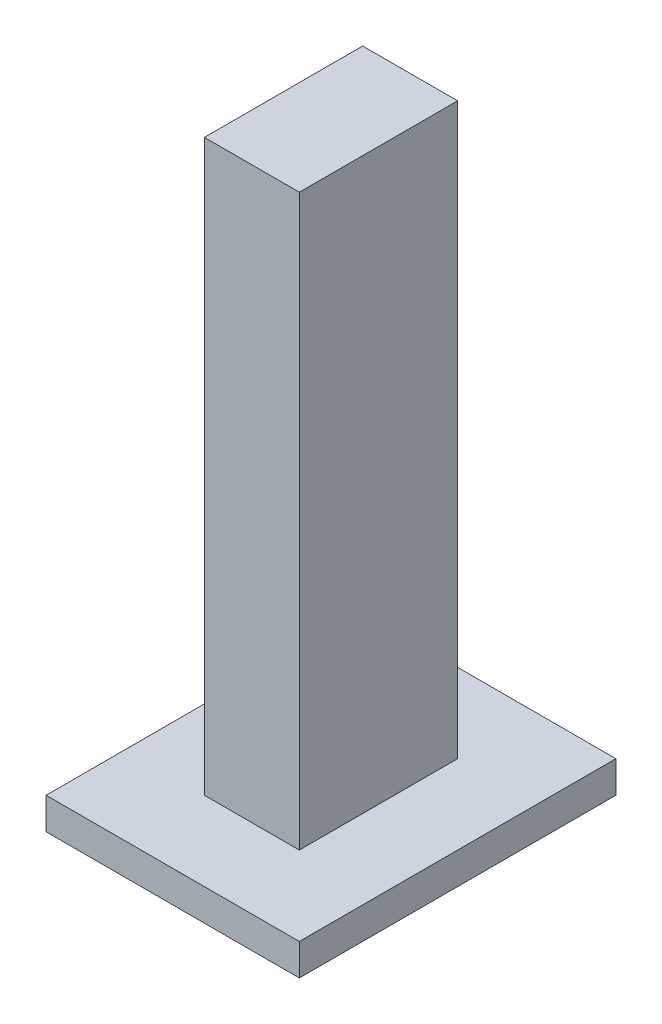
ISO-10303-21;
HEADER;
FILE_DESCRIPTION(('STEP AP214'),'2;1');
FILE_NAME('part.step','',(''),(''),'','','');
FILE_SCHEMA(('AUTOMOTIVE_DESIGN { 1 0 10303 214 1 1 1 1 }'));
ENDSEC;
DATA;
#1=APPLICATION_CONTEXT('core data for automotive mechanical design processes');
#2=APPLICATION_PROTOCOL_DEFINITION('international standard','automotive_design',2000,#1);
#3=PRODUCT_CONTEXT('',#1,'mechanical');
#4=PRODUCT('Part','Part','',(#3));
#5=PRODUCT_RELATED_PRODUCT_CATEGORY('part','',(#4));
#6=PRODUCT_DEFINITION_FORMATION('','',#4);
#7=PRODUCT_DEFINITION_CONTEXT('part definition',#1,'design');
#8=PRODUCT_DEFINITION('design','',#6,#7);
#9=PRODUCT_DEFINITION_SHAPE('','',#8);
#10=(LENGTH_UNIT() NAMED_UNIT(*) SI_UNIT(.MILLI.,.METRE.));
#11=(NAMED_UNIT(*) PLANE_ANGLE_UNIT() SI_UNIT($,.RADIAN.));
#12=(NAMED_UNIT(*) SI_UNIT($,.STERADIAN.) SOLID_ANGLE_UNIT());
#13=UNCERTAINTY_MEASURE_WITH_UNIT(LENGTH_MEASURE(1.E-05),#10,'distance_accuracy_value','');
#14=(GEOMETRIC_REPRESENTATION_CONTEXT(3) GLOBAL_UNCERTAINTY_ASSIGNED_CONTEXT((#13)) GLOBAL_UNIT_ASSIGNED_CONTEXT((#10,
#11,#12)) REPRESENTATION_CONTEXT('',''));
#15=CARTESIAN_POINT('',(0.,0.,0.));
#16=DIRECTION('',(0.,0.,1.));
#17=DIRECTION('',(1.,0.,0.));
#18=AXIS2_PLACEMENT_3D('',#15,#16,#17);
#19=CARTESIAN_POINT('',(-15.,45.,25.));
#20=DIRECTION('',(1.,0.,0.));
#21=DIRECTION('',(0.,0.,-1.));
#22=AXIS2_PLACEMENT_3D('',#19,#20,#21);
#23=PLANE('',#22);
#24=DIRECTION('',(0.,-1.,0.));
#25=VECTOR('',#24,1.);
#26=CARTESIAN_POINT('',(-15.,45.,0.));
#27=LINE('',#26,#25);
#28=CARTESIAN_POINT('',(-15.,45.,0.));
#29=VERTEX_POINT('',#28);
#30=CARTESIAN_POINT('',(-15.,-45.,0.));
#31=VERTEX_POINT('',#30);
#32=EDGE_CURVE('E140',#29,#31,#27,.T.);
#33=ORIENTED_EDGE('',*,*,#32,.T.);
#34=DIRECTION('',(0.,0.,-1.));
#35=VECTOR('',#34,1.);
#36=CARTESIAN_POINT('',(-15.,-45.,25.));
#37=LINE('',#36,#35);
#38=CARTESIAN_POINT('',(-15.,-45.,25.));
#39=VERTEX_POINT('',#38);
#40=EDGE_CURVE('E11',#39,#31,#37,.T.);
#41=ORIENTED_EDGE('',*,*,#40,.F.);
#42=DIRECTION('',(0.,-1.,0.));
#43=VECTOR('',#42,1.);
#44=CARTESIAN_POINT('',(-15.,45.,25.));
#45=LINE('',#44,#43);
#46=CARTESIAN_POINT('',(-15.,45.,25.));
#47=VERTEX_POINT('',#46);
#48=EDGE_CURVE('E81',#47,#39,#45,.T.);
#49=ORIENTED_EDGE('',*,*,#48,.F.);
#50=DIRECTION('',(0.,0.,-1.));
#51=VECTOR('',#50,1.);
#52=CARTESIAN_POINT('',(-15.,45.,25.));
#53=LINE('',#52,#51);
#54=EDGE_CURVE('E159',#47,#29,#53,.T.);
#55=ORIENTED_EDGE('',*,*,#54,.T.);
#56=EDGE_LOOP('',(#33,#41,#49,#55));
#57=FACE_BOUND('',#56,.T.);
#58=ADVANCED_FACE('F39',(#57),#23,.F.);
#59=CARTESIAN_POINT('',(0.,45.,25.));
#60=DIRECTION('',(-1.,0.,0.));
#61=DIRECTION('',(0.,0.,1.));
#62=AXIS2_PLACEMENT_3D('',#59,#60,#61);
#63=PLANE('',#62);
#64=DIRECTION('',(0.,1.,0.));
#65=VECTOR('',#64,1.);
#66=CARTESIAN_POINT('',(0.,45.,0.));
#67=LINE('',#66,#65);
#68=CARTESIAN_POINT('',(0.,-45.,0.));
#69=VERTEX_POINT('',#68);
#70=CARTESIAN_POINT('',(0.,45.,0.));
#71=VERTEX_POINT('',#70);
#72=EDGE_CURVE('E70',#69,#71,#67,.T.);
#73=ORIENTED_EDGE('',*,*,#72,.T.);
#74=DIRECTION('',(0.,0.,-1.));
#75=VECTOR('',#74,1.);
#76=CARTESIAN_POINT('',(0.,45.,25.));
#77=LINE('',#76,#75);
#78=CARTESIAN_POINT('',(0.,45.,25.));
#79=VERTEX_POINT('',#78);
#80=EDGE_CURVE('E170',#79,#71,#77,.T.);
#81=ORIENTED_EDGE('',*,*,#80,.F.);
#82=DIRECTION('',(0.,1.,0.));
#83=VECTOR('',#82,1.);
#84=CARTESIAN_POINT('',(0.,45.,25.));
#85=LINE('',#84,#83);
#86=CARTESIAN_POINT('',(0.,-45.,25.));
#87=VERTEX_POINT('',#86);
#88=EDGE_CURVE('E155',#87,#79,#85,.T.);
#89=ORIENTED_EDGE('',*,*,#88,.F.);
#90=DIRECTION('',(0.,0.,-1.));
#91=VECTOR('',#90,1.);
#92=CARTESIAN_POINT('',(0.,-45.,25.));
#93=LINE('',#92,#91);
#94=EDGE_CURVE('E48',#87,#69,#93,.T.);
#95=ORIENTED_EDGE('',*,*,#94,.T.);
#96=EDGE_LOOP('',(#73,#81,#89,#95));
#97=FACE_BOUND('',#96,.T.);
#98=ADVANCED_FACE('F175',(#97),#63,.F.);
#99=CARTESIAN_POINT('',(-15.,45.,25.));
#100=DIRECTION('',(0.,-1.,0.));
#101=DIRECTION('',(0.,0.,-1.));
#102=AXIS2_PLACEMENT_3D('',#99,#100,#101);
#103=PLANE('',#102);
#104=DIRECTION('',(-1.,0.,0.));
#105=VECTOR('',#104,1.);
#106=CARTESIAN_POINT('',(-15.,45.,0.));
#107=LINE('',#106,#105);
#108=EDGE_CURVE('E76',#71,#29,#107,.T.);
#109=ORIENTED_EDGE('',*,*,#108,.T.);
#110=ORIENTED_EDGE('',*,*,#54,.F.);
#111=DIRECTION('',(-1.,0.,0.));
#112=VECTOR('',#111,1.);
#113=CARTESIAN_POINT('',(-15.,45.,25.));
#114=LINE('',#113,#112);
#115=EDGE_CURVE('E56',#79,#47,#114,.T.);
#116=ORIENTED_EDGE('',*,*,#115,.F.);
#117=ORIENTED_EDGE('',*,*,#80,.T.);
#118=EDGE_LOOP('',(#109,#110,#116,#117));
#119=FACE_BOUND('',#118,.T.);
#120=ADVANCED_FACE('F184',(#119),#103,.F.);
#121=CARTESIAN_POINT('',(0.,0.,25.));
#122=DIRECTION('',(0.,0.,1.));
#123=DIRECTION('',(1.,0.,0.));
#124=AXIS2_PLACEMENT_3D('',#121,#122,#123);
#125=PLANE('',#124);
#126=ORIENTED_EDGE('',*,*,#48,.T.);
#127=DIRECTION('',(1.,0.,0.));
#128=VECTOR('',#127,1.);
#129=CARTESIAN_POINT('',(-15.,-45.,25.));
#130=LINE('',#129,#128);
#131=EDGE_CURVE('E152',#39,#87,#130,.T.);
#132=ORIENTED_EDGE('',*,*,#131,.T.);
#133=ORIENTED_EDGE('',*,*,#88,.T.);
#134=ORIENTED_EDGE('',*,*,#115,.T.);
#135=EDGE_LOOP('',(#126,#132,#133,#134));
#136=FACE_BOUND('',#135,.T.);
#137=ADVANCED_FACE('F186',(#136),#125,.T.);
#138=CARTESIAN_POINT('',(0.,0.,0.));
#139=DIRECTION('',(0.,0.,1.));
#140=DIRECTION('',(1.,0.,0.));
#141=AXIS2_PLACEMENT_3D('',#138,#139,#140);
#142=PLANE('',#141);
#143=ORIENTED_EDGE('',*,*,#32,.F.);
#144=ORIENTED_EDGE('',*,*,#108,.F.);
#145=ORIENTED_EDGE('',*,*,#72,.F.);
#146=DIRECTION('',(1.,0.,0.));
#147=VECTOR('',#146,1.);
#148=CARTESIAN_POINT('',(-15.,-45.,0.));
#149=LINE('',#148,#147);
#150=EDGE_CURVE('E144',#31,#69,#149,.T.);
#151=ORIENTED_EDGE('',*,*,#150,.F.);
#152=EDGE_LOOP('',(#143,#144,#145,#151));
#153=FACE_BOUND('',#152,.T.);
#154=ADVANCED_FACE('F181',(#153),#142,.F.);
#155=CARTESIAN_POINT('',(0.,-45.,0.));
#156=DIRECTION('',(0.,-1.,0.));
#157=DIRECTION('',(0.,0.,-1.));
#158=AXIS2_PLACEMENT_3D('',#155,#156,#157);
#159=PLANE('',#158);
#160=DIRECTION('',(0.,0.,-1.));
#161=VECTOR('',#160,1.);
#162=CARTESIAN_POINT('',(-27.5,-45.,37.5));
#163=LINE('',#162,#161);
#164=CARTESIAN_POINT('',(-27.5,-45.,37.5));
#165=VERTEX_POINT('',#164);
#166=CARTESIAN_POINT('',(-27.5,-45.,-12.5));
#167=VERTEX_POINT('',#166);
#168=EDGE_CURVE('E138',#165,#167,#163,.T.);
#169=ORIENTED_EDGE('',*,*,#168,.F.);
#170=DIRECTION('',(-1.,0.,0.));
#171=VECTOR('',#170,1.);
#172=CARTESIAN_POINT('',(-27.5,-45.,37.5));
#173=LINE('',#172,#171);
#174=CARTESIAN_POINT('',(12.5,-45.,37.5));
#175=VERTEX_POINT('',#174);
#176=EDGE_CURVE('E134',#175,#165,#173,.T.);
#177=ORIENTED_EDGE('',*,*,#176,.F.);
#178=DIRECTION('',(0.,0.,1.));
#179=VECTOR('',#178,1.);
#180=CARTESIAN_POINT('',(12.5,-45.,37.5));
#181=LINE('',#180,#179);
#182=CARTESIAN_POINT('',(12.5,-45.,-12.5));
#183=VERTEX_POINT('',#182);
#184=EDGE_CURVE('E278',#183,#175,#181,.T.);
#185=ORIENTED_EDGE('',*,*,#184,.F.);
#186=DIRECTION('',(1.,0.,0.));
#187=VECTOR('',#186,1.);
#188=CARTESIAN_POINT('',(-27.5,-45.,-12.5));
#189=LINE('',#188,#187);
#190=EDGE_CURVE('E282',#167,#183,#189,.T.);
#191=ORIENTED_EDGE('',*,*,#190,.F.);
#192=EDGE_LOOP('',(#169,#177,#185,#191));
#193=FACE_BOUND('',#192,.T.);
#194=ORIENTED_EDGE('',*,*,#40,.T.);
#195=ORIENTED_EDGE('',*,*,#150,.T.);
#196=ORIENTED_EDGE('',*,*,#94,.F.);
#197=ORIENTED_EDGE('',*,*,#131,.F.);
#198=EDGE_LOOP('',(#194,#195,#196,#197));
#199=FACE_BOUND('',#198,.T.);
#200=ADVANCED_FACE('F182',(#193,#199),#159,.F.);
#201=CARTESIAN_POINT('',(-27.5,-50.,37.5));
#202=DIRECTION('',(1.,0.,0.));
#203=DIRECTION('',(0.,0.,-1.));
#204=AXIS2_PLACEMENT_3D('',#201,#202,#203);
#205=PLANE('',#204);
#206=ORIENTED_EDGE('',*,*,#168,.T.);
#207=DIRECTION('',(0.,1.,0.));
#208=VECTOR('',#207,1.);
#209=CARTESIAN_POINT('',(-27.5,-50.,-12.5));
#210=LINE('',#209,#208);
#211=CARTESIAN_POINT('',(-27.5,-50.,-12.5));
#212=VERTEX_POINT('',#211);
#213=EDGE_CURVE('E116',#212,#167,#210,.T.);
#214=ORIENTED_EDGE('',*,*,#213,.F.);
#215=DIRECTION('',(0.,0.,-1.));
#216=VECTOR('',#215,1.);
#217=CARTESIAN_POINT('',(-27.5,-50.,37.5));
#218=LINE('',#217,#216);
#219=CARTESIAN_POINT('',(-27.5,-50.,37.5));
#220=VERTEX_POINT('',#219);
#221=EDGE_CURVE('E124',#220,#212,#218,.T.);
#222=ORIENTED_EDGE('',*,*,#221,.F.);
#223=DIRECTION('',(0.,1.,0.));
#224=VECTOR('',#223,1.);
#225=CARTESIAN_POINT('',(-27.5,-50.,37.5));
#226=LINE('',#225,#224);
#227=EDGE_CURVE('E274',#220,#165,#226,.T.);
#228=ORIENTED_EDGE('',*,*,#227,.T.);
#229=EDGE_LOOP('',(#206,#214,#222,#228));
#230=FACE_BOUND('',#229,.T.);
#231=ADVANCED_FACE('F136',(#230),#205,.F.);
#232=CARTESIAN_POINT('',(-27.5,-50.,-12.5));
#233=DIRECTION('',(0.,0.,1.));
#234=DIRECTION('',(1.,0.,0.));
#235=AXIS2_PLACEMENT_3D('',#232,#233,#234);
#236=PLANE('',#235);
#237=ORIENTED_EDGE('',*,*,#190,.T.);
#238=DIRECTION('',(0.,1.,0.));
#239=VECTOR('',#238,1.);
#240=CARTESIAN_POINT('',(12.5,-50.,-12.5));
#241=LINE('',#240,#239);
#242=CARTESIAN_POINT('',(12.5,-50.,-12.5));
#243=VERTEX_POINT('',#242);
#244=EDGE_CURVE('E119',#243,#183,#241,.T.);
#245=ORIENTED_EDGE('',*,*,#244,.F.);
#246=DIRECTION('',(1.,0.,0.));
#247=VECTOR('',#246,1.);
#248=CARTESIAN_POINT('',(-27.5,-50.,-12.5));
#249=LINE('',#248,#247);
#250=EDGE_CURVE('E112',#212,#243,#249,.T.);
#251=ORIENTED_EDGE('',*,*,#250,.F.);
#252=ORIENTED_EDGE('',*,*,#213,.T.);
#253=EDGE_LOOP('',(#237,#245,#251,#252));
#254=FACE_BOUND('',#253,.T.);
#255=ADVANCED_FACE('F114',(#254),#236,.F.);
#256=CARTESIAN_POINT('',(12.5,-50.,37.5));
#257=DIRECTION('',(-1.,0.,0.));
#258=DIRECTION('',(0.,0.,1.));
#259=AXIS2_PLACEMENT_3D('',#256,#257,#258);
#260=PLANE('',#259);
#261=ORIENTED_EDGE('',*,*,#184,.T.);
#262=DIRECTION('',(0.,1.,0.));
#263=VECTOR('',#262,1.);
#264=CARTESIAN_POINT('',(12.5,-50.,37.5));
#265=LINE('',#264,#263);
#266=CARTESIAN_POINT('',(12.5,-50.,37.5));
#267=VERTEX_POINT('',#266);
#268=EDGE_CURVE('E146',#267,#175,#265,.T.);
#269=ORIENTED_EDGE('',*,*,#268,.F.);
#270=DIRECTION('',(0.,0.,1.));
#271=VECTOR('',#270,1.);
#272=CARTESIAN_POINT('',(12.5,-50.,37.5));
#273=LINE('',#272,#271);
#274=EDGE_CURVE('E123',#243,#267,#273,.T.);
#275=ORIENTED_EDGE('',*,*,#274,.F.);
#276=ORIENTED_EDGE('',*,*,#244,.T.);
#277=EDGE_LOOP('',(#261,#269,#275,#276));
#278=FACE_BOUND('',#277,.T.);
#279=ADVANCED_FACE('F241',(#278),#260,.F.);
#280=CARTESIAN_POINT('',(-27.5,-50.,37.5));
#281=DIRECTION('',(0.,0.,-1.));
#282=DIRECTION('',(-1.,0.,0.));
#283=AXIS2_PLACEMENT_3D('',#280,#281,#282);
#284=PLANE('',#283);
#285=ORIENTED_EDGE('',*,*,#176,.T.);
#286=ORIENTED_EDGE('',*,*,#227,.F.);
#287=DIRECTION('',(-1.,0.,0.));
#288=VECTOR('',#287,1.);
#289=CARTESIAN_POINT('',(-27.5,-50.,37.5));
#290=LINE('',#289,#288);
#291=EDGE_CURVE('E129',#267,#220,#290,.T.);
#292=ORIENTED_EDGE('',*,*,#291,.F.);
#293=ORIENTED_EDGE('',*,*,#268,.T.);
#294=EDGE_LOOP('',(#285,#286,#292,#293));
#295=FACE_BOUND('',#294,.T.);
#296=ADVANCED_FACE('F250',(#295),#284,.F.);
#297=CARTESIAN_POINT('',(0.,-50.,0.));
#298=DIRECTION('',(0.,-1.,0.));
#299=DIRECTION('',(0.,0.,-1.));
#300=AXIS2_PLACEMENT_3D('',#297,#298,#299);
#301=PLANE('',#300);
#302=ORIENTED_EDGE('',*,*,#221,.T.);
#303=ORIENTED_EDGE('',*,*,#250,.T.);
#304=ORIENTED_EDGE('',*,*,#274,.T.);
#305=ORIENTED_EDGE('',*,*,#291,.T.);
#306=EDGE_LOOP('',(#302,#303,#304,#305));
#307=FACE_BOUND('',#306,.T.);
#308=ADVANCED_FACE('F127',(#307),#301,.T.);
#309=CLOSED_SHELL('',(#58,#98,#120,#137,#154,#200,#231,#255,#279,#296,#308));
#310=MANIFOLD_SOLID_BREP('B2',#309);
#311=ADVANCED_BREP_SHAPE_REPRESENTATION('',(#18,#310),#14);
#312=SHAPE_DEFINITION_REPRESENTATION(#9,#311);
ENDSEC;
END-ISO-10303-21;
